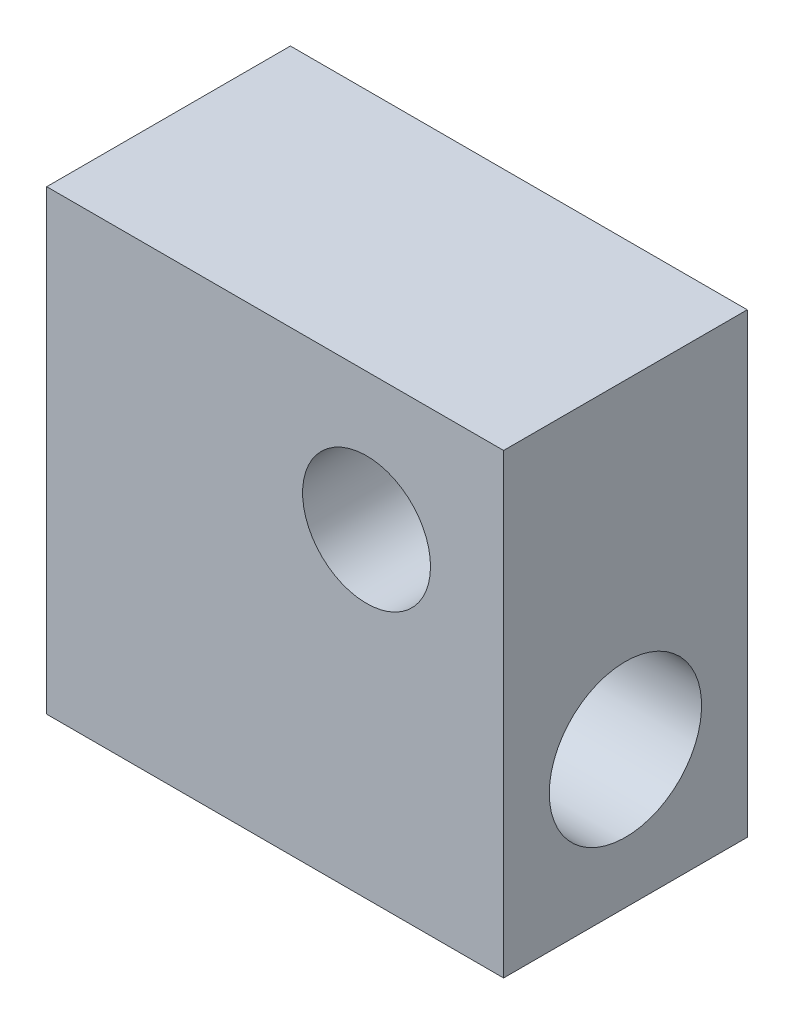
ISO-10303-21;
HEADER;
FILE_DESCRIPTION(('STEP AP214'),'2;1');
FILE_NAME('part.step','',(''),(''),'','','');
FILE_SCHEMA(('AUTOMOTIVE_DESIGN { 1 0 10303 214 1 1 1 1 }'));
ENDSEC;
DATA;
#1=APPLICATION_CONTEXT('core data for automotive mechanical design processes');
#2=APPLICATION_PROTOCOL_DEFINITION('international standard','automotive_design',2000,#1);
#3=PRODUCT_CONTEXT('',#1,'mechanical');
#4=PRODUCT('Part','Part','',(#3));
#5=PRODUCT_RELATED_PRODUCT_CATEGORY('part','',(#4));
#6=PRODUCT_DEFINITION_FORMATION('','',#4);
#7=PRODUCT_DEFINITION_CONTEXT('part definition',#1,'design');
#8=PRODUCT_DEFINITION('design','',#6,#7);
#9=PRODUCT_DEFINITION_SHAPE('','',#8);
#10=(LENGTH_UNIT() NAMED_UNIT(*) SI_UNIT(.MILLI.,.METRE.));
#11=(NAMED_UNIT(*) PLANE_ANGLE_UNIT() SI_UNIT($,.RADIAN.));
#12=(NAMED_UNIT(*) SI_UNIT($,.STERADIAN.) SOLID_ANGLE_UNIT());
#13=UNCERTAINTY_MEASURE_WITH_UNIT(LENGTH_MEASURE(1.E-05),#10,'distance_accuracy_value','');
#14=(GEOMETRIC_REPRESENTATION_CONTEXT(3) GLOBAL_UNCERTAINTY_ASSIGNED_CONTEXT((#13)) GLOBAL_UNIT_ASSIGNED_CONTEXT((#10,
#11,#12)) REPRESENTATION_CONTEXT('',''));
#15=CARTESIAN_POINT('',(0.,0.,0.));
#16=DIRECTION('',(0.,0.,1.));
#17=DIRECTION('',(1.,0.,0.));
#18=AXIS2_PLACEMENT_3D('',#15,#16,#17);
#19=CARTESIAN_POINT('',(0.,0.,8.));
#20=DIRECTION('',(1.,0.,0.));
#21=DIRECTION('',(0.,0.,-1.));
#22=AXIS2_PLACEMENT_3D('',#19,#20,#21);
#23=PLANE('',#22);
#24=CARTESIAN_POINT('',(0.,10.5,4.));
#25=DIRECTION('',(-1.,0.,0.));
#26=DIRECTION('',(0.,0.,1.));
#27=AXIS2_PLACEMENT_3D('',#24,#25,#26);
#28=CIRCLE('',#27,1.25);
#29=CARTESIAN_POINT('',(0.,10.5,5.25));
#30=VERTEX_POINT('',#29);
#31=EDGE_CURVE('E92',#30,#30,#28,.T.);
#32=ORIENTED_EDGE('',*,*,#31,.F.);
#33=EDGE_LOOP('',(#32));
#34=FACE_BOUND('',#33,.T.);
#35=CARTESIAN_POINT('',(0.,4.5,4.));
#36=DIRECTION('',(-1.,0.,0.));
#37=DIRECTION('',(0.,0.,1.));
#38=AXIS2_PLACEMENT_3D('',#35,#36,#37);
#39=CIRCLE('',#38,2.49999999999999);
#40=CARTESIAN_POINT('',(0.,4.5,6.49999999999999));
#41=VERTEX_POINT('',#40);
#42=EDGE_CURVE('E91',#41,#41,#39,.T.);
#43=ORIENTED_EDGE('',*,*,#42,.F.);
#44=EDGE_LOOP('',(#43));
#45=FACE_BOUND('',#44,.T.);
#46=DIRECTION('',(0.,-1.,0.));
#47=VECTOR('',#46,1.);
#48=CARTESIAN_POINT('',(0.,0.,0.));
#49=LINE('',#48,#47);
#50=CARTESIAN_POINT('',(0.,15.,0.));
#51=VERTEX_POINT('',#50);
#52=CARTESIAN_POINT('',(0.,0.,0.));
#53=VERTEX_POINT('',#52);
#54=EDGE_CURVE('E108',#51,#53,#49,.T.);
#55=ORIENTED_EDGE('',*,*,#54,.T.);
#56=DIRECTION('',(0.,0.,-1.));
#57=VECTOR('',#56,1.);
#58=CARTESIAN_POINT('',(0.,0.,8.));
#59=LINE('',#58,#57);
#60=CARTESIAN_POINT('',(0.,0.,8.));
#61=VERTEX_POINT('',#60);
#62=EDGE_CURVE('E11',#61,#53,#59,.T.);
#63=ORIENTED_EDGE('',*,*,#62,.F.);
#64=DIRECTION('',(0.,-1.,0.));
#65=VECTOR('',#64,1.);
#66=CARTESIAN_POINT('',(0.,0.,8.));
#67=LINE('',#66,#65);
#68=CARTESIAN_POINT('',(0.,15.,8.));
#69=VERTEX_POINT('',#68);
#70=EDGE_CURVE('E109',#69,#61,#67,.T.);
#71=ORIENTED_EDGE('',*,*,#70,.F.);
#72=DIRECTION('',(0.,0.,-1.));
#73=VECTOR('',#72,1.);
#74=CARTESIAN_POINT('',(0.,15.,8.));
#75=LINE('',#74,#73);
#76=EDGE_CURVE('E115',#69,#51,#75,.T.);
#77=ORIENTED_EDGE('',*,*,#76,.T.);
#78=EDGE_LOOP('',(#55,#63,#71,#77));
#79=FACE_BOUND('',#78,.T.);
#80=ADVANCED_FACE('F30',(#34,#45,#79),#23,.F.);
#81=CARTESIAN_POINT('',(0.,0.,8.));
#82=DIRECTION('',(0.,1.,0.));
#83=DIRECTION('',(0.,0.,1.));
#84=AXIS2_PLACEMENT_3D('',#81,#82,#83);
#85=PLANE('',#84);
#86=DIRECTION('',(1.,0.,0.));
#87=VECTOR('',#86,1.);
#88=CARTESIAN_POINT('',(0.,0.,0.));
#89=LINE('',#88,#87);
#90=CARTESIAN_POINT('',(15.,0.,0.));
#91=VERTEX_POINT('',#90);
#92=EDGE_CURVE('E118',#53,#91,#89,.T.);
#93=ORIENTED_EDGE('',*,*,#92,.T.);
#94=DIRECTION('',(0.,0.,-1.));
#95=VECTOR('',#94,1.);
#96=CARTESIAN_POINT('',(15.,0.,8.));
#97=LINE('',#96,#95);
#98=CARTESIAN_POINT('',(15.,0.,8.));
#99=VERTEX_POINT('',#98);
#100=EDGE_CURVE('E38',#99,#91,#97,.T.);
#101=ORIENTED_EDGE('',*,*,#100,.F.);
#102=DIRECTION('',(1.,0.,0.));
#103=VECTOR('',#102,1.);
#104=CARTESIAN_POINT('',(0.,0.,8.));
#105=LINE('',#104,#103);
#106=EDGE_CURVE('E77',#61,#99,#105,.T.);
#107=ORIENTED_EDGE('',*,*,#106,.F.);
#108=ORIENTED_EDGE('',*,*,#62,.T.);
#109=EDGE_LOOP('',(#93,#101,#107,#108));
#110=FACE_BOUND('',#109,.T.);
#111=ADVANCED_FACE('F142',(#110),#85,.F.);
#112=CARTESIAN_POINT('',(15.,0.,8.));
#113=DIRECTION('',(-1.,0.,0.));
#114=DIRECTION('',(0.,0.,1.));
#115=AXIS2_PLACEMENT_3D('',#112,#113,#114);
#116=PLANE('',#115);
#117=CARTESIAN_POINT('',(15.,4.5,4.));
#118=DIRECTION('',(-1.,0.,0.));
#119=DIRECTION('',(0.,0.,1.));
#120=AXIS2_PLACEMENT_3D('',#117,#118,#119);
#121=CIRCLE('',#120,2.5);
#122=CARTESIAN_POINT('',(15.,4.5,6.5));
#123=VERTEX_POINT('',#122);
#124=EDGE_CURVE('E95',#123,#123,#121,.T.);
#125=ORIENTED_EDGE('',*,*,#124,.T.);
#126=EDGE_LOOP('',(#125));
#127=FACE_BOUND('',#126,.T.);
#128=DIRECTION('',(0.,1.,0.));
#129=VECTOR('',#128,1.);
#130=CARTESIAN_POINT('',(15.,0.,0.));
#131=LINE('',#130,#129);
#132=CARTESIAN_POINT('',(15.,15.,0.));
#133=VERTEX_POINT('',#132);
#134=EDGE_CURVE('E64',#91,#133,#131,.T.);
#135=ORIENTED_EDGE('',*,*,#134,.T.);
#136=DIRECTION('',(0.,0.,-1.));
#137=VECTOR('',#136,1.);
#138=CARTESIAN_POINT('',(15.,15.,8.));
#139=LINE('',#138,#137);
#140=CARTESIAN_POINT('',(15.,15.,8.));
#141=VERTEX_POINT('',#140);
#142=EDGE_CURVE('E123',#141,#133,#139,.T.);
#143=ORIENTED_EDGE('',*,*,#142,.F.);
#144=DIRECTION('',(0.,1.,0.));
#145=VECTOR('',#144,1.);
#146=CARTESIAN_POINT('',(15.,0.,8.));
#147=LINE('',#146,#145);
#148=EDGE_CURVE('E112',#99,#141,#147,.T.);
#149=ORIENTED_EDGE('',*,*,#148,.F.);
#150=ORIENTED_EDGE('',*,*,#100,.T.);
#151=EDGE_LOOP('',(#135,#143,#149,#150));
#152=FACE_BOUND('',#151,.T.);
#153=ADVANCED_FACE('F125',(#127,#152),#116,.F.);
#154=CARTESIAN_POINT('',(0.,15.,8.));
#155=DIRECTION('',(0.,-1.,0.));
#156=DIRECTION('',(0.,0.,-1.));
#157=AXIS2_PLACEMENT_3D('',#154,#155,#156);
#158=PLANE('',#157);
#159=DIRECTION('',(-1.,0.,0.));
#160=VECTOR('',#159,1.);
#161=CARTESIAN_POINT('',(0.,15.,0.));
#162=LINE('',#161,#160);
#163=EDGE_CURVE('E70',#133,#51,#162,.T.);
#164=ORIENTED_EDGE('',*,*,#163,.T.);
#165=ORIENTED_EDGE('',*,*,#76,.F.);
#166=DIRECTION('',(-1.,0.,0.));
#167=VECTOR('',#166,1.);
#168=CARTESIAN_POINT('',(0.,15.,8.));
#169=LINE('',#168,#167);
#170=EDGE_CURVE('E46',#141,#69,#169,.T.);
#171=ORIENTED_EDGE('',*,*,#170,.F.);
#172=ORIENTED_EDGE('',*,*,#142,.T.);
#173=EDGE_LOOP('',(#164,#165,#171,#172));
#174=FACE_BOUND('',#173,.T.);
#175=ADVANCED_FACE('F132',(#174),#158,.F.);
#176=CARTESIAN_POINT('',(0.,15.,8.));
#177=DIRECTION('',(0.,0.,-1.));
#178=DIRECTION('',(-1.,0.,0.));
#179=AXIS2_PLACEMENT_3D('',#176,#177,#178);
#180=PLANE('',#179);
#181=CARTESIAN_POINT('',(10.5,10.5,8.));
#182=DIRECTION('',(0.,0.,1.));
#183=DIRECTION('',(1.,0.,0.));
#184=AXIS2_PLACEMENT_3D('',#181,#182,#183);
#185=CIRCLE('',#184,2.09999999999999);
#186=CARTESIAN_POINT('',(12.6,10.5,8.));
#187=VERTEX_POINT('',#186);
#188=EDGE_CURVE('E102',#187,#187,#185,.T.);
#189=ORIENTED_EDGE('',*,*,#188,.F.);
#190=EDGE_LOOP('',(#189));
#191=FACE_BOUND('',#190,.T.);
#192=ORIENTED_EDGE('',*,*,#70,.T.);
#193=ORIENTED_EDGE('',*,*,#106,.T.);
#194=ORIENTED_EDGE('',*,*,#148,.T.);
#195=ORIENTED_EDGE('',*,*,#170,.T.);
#196=EDGE_LOOP('',(#192,#193,#194,#195));
#197=FACE_BOUND('',#196,.T.);
#198=ADVANCED_FACE('F134',(#191,#197),#180,.F.);
#199=CARTESIAN_POINT('',(0.,15.,0.));
#200=DIRECTION('',(0.,0.,-1.));
#201=DIRECTION('',(-1.,0.,0.));
#202=AXIS2_PLACEMENT_3D('',#199,#200,#201);
#203=PLANE('',#202);
#204=CARTESIAN_POINT('',(10.5,10.5,0.));
#205=DIRECTION('',(0.,0.,1.));
#206=DIRECTION('',(1.,0.,0.));
#207=AXIS2_PLACEMENT_3D('',#204,#205,#206);
#208=CIRCLE('',#207,2.1);
#209=CARTESIAN_POINT('',(12.6,10.5,0.));
#210=VERTEX_POINT('',#209);
#211=EDGE_CURVE('E105',#210,#210,#208,.T.);
#212=ORIENTED_EDGE('',*,*,#211,.T.);
#213=EDGE_LOOP('',(#212));
#214=FACE_BOUND('',#213,.T.);
#215=ORIENTED_EDGE('',*,*,#54,.F.);
#216=ORIENTED_EDGE('',*,*,#163,.F.);
#217=ORIENTED_EDGE('',*,*,#134,.F.);
#218=ORIENTED_EDGE('',*,*,#92,.F.);
#219=EDGE_LOOP('',(#215,#216,#217,#218));
#220=FACE_BOUND('',#219,.T.);
#221=ADVANCED_FACE('F128',(#214,#220),#203,.T.);
#222=CARTESIAN_POINT('',(10.5,10.5,8.));
#223=DIRECTION('',(0.,0.,1.));
#224=DIRECTION('',(1.,0.,0.));
#225=AXIS2_PLACEMENT_3D('',#222,#223,#224);
#226=CYLINDRICAL_SURFACE('',#225,2.09999999999999);
#227=ORIENTED_EDGE('',*,*,#211,.F.);
#228=EDGE_LOOP('',(#227));
#229=FACE_BOUND('',#228,.T.);
#230=ORIENTED_EDGE('',*,*,#188,.T.);
#231=EDGE_LOOP('',(#230));
#232=FACE_BOUND('',#231,.T.);
#233=ADVANCED_FACE('F156',(#229,#232),#226,.F.);
#234=CARTESIAN_POINT('',(0.,4.5,4.));
#235=DIRECTION('',(-1.,0.,0.));
#236=DIRECTION('',(0.,0.,1.));
#237=AXIS2_PLACEMENT_3D('',#234,#235,#236);
#238=CYLINDRICAL_SURFACE('',#237,2.49999999999999);
#239=ORIENTED_EDGE('',*,*,#124,.F.);
#240=EDGE_LOOP('',(#239));
#241=FACE_BOUND('',#240,.T.);
#242=ORIENTED_EDGE('',*,*,#42,.T.);
#243=EDGE_LOOP('',(#242));
#244=FACE_BOUND('',#243,.T.);
#245=ADVANCED_FACE('F85',(#241,#244),#238,.F.);
#246=CARTESIAN_POINT('',(6.05,10.5,4.));
#247=DIRECTION('',(-1.,0.,0.));
#248=DIRECTION('',(0.,0.,1.));
#249=AXIS2_PLACEMENT_3D('',#246,#247,#248);
#250=CONICAL_SURFACE('',#249,1.25,1.02974425867665);
#251=CARTESIAN_POINT('',(6.80107577378445,10.5,4.));
#252=VERTEX_POINT('',#251);
#253=VERTEX_LOOP('',#252);
#254=FACE_BOUND('',#253,.T.);
#255=CARTESIAN_POINT('',(6.05,10.5,4.));
#256=DIRECTION('',(-1.,0.,0.));
#257=DIRECTION('',(0.,0.,1.));
#258=AXIS2_PLACEMENT_3D('',#255,#256,#257);
#259=CIRCLE('',#258,1.25);
#260=CARTESIAN_POINT('',(6.05,10.5,5.25));
#261=VERTEX_POINT('',#260);
#262=EDGE_CURVE('E89',#261,#261,#259,.T.);
#263=ORIENTED_EDGE('',*,*,#262,.T.);
#264=EDGE_LOOP('',(#263));
#265=FACE_BOUND('',#264,.T.);
#266=ADVANCED_FACE('F81',(#254,#265),#250,.F.);
#267=CARTESIAN_POINT('',(0.,10.5,4.));
#268=DIRECTION('',(-1.,0.,0.));
#269=DIRECTION('',(0.,0.,1.));
#270=AXIS2_PLACEMENT_3D('',#267,#268,#269);
#271=CYLINDRICAL_SURFACE('',#270,1.25);
#272=ORIENTED_EDGE('',*,*,#262,.F.);
#273=EDGE_LOOP('',(#272));
#274=FACE_BOUND('',#273,.T.);
#275=ORIENTED_EDGE('',*,*,#31,.T.);
#276=EDGE_LOOP('',(#275));
#277=FACE_BOUND('',#276,.T.);
#278=ADVANCED_FACE('F84',(#274,#277),#271,.F.);
#279=CLOSED_SHELL('',(#80,#111,#153,#175,#198,#221,#233,#245,#266,#278));
#280=MANIFOLD_SOLID_BREP('B2',#279);
#281=ADVANCED_BREP_SHAPE_REPRESENTATION('',(#18,#280),#14);
#282=SHAPE_DEFINITION_REPRESENTATION(#9,#281);
ENDSEC;
END-ISO-10303-21;
